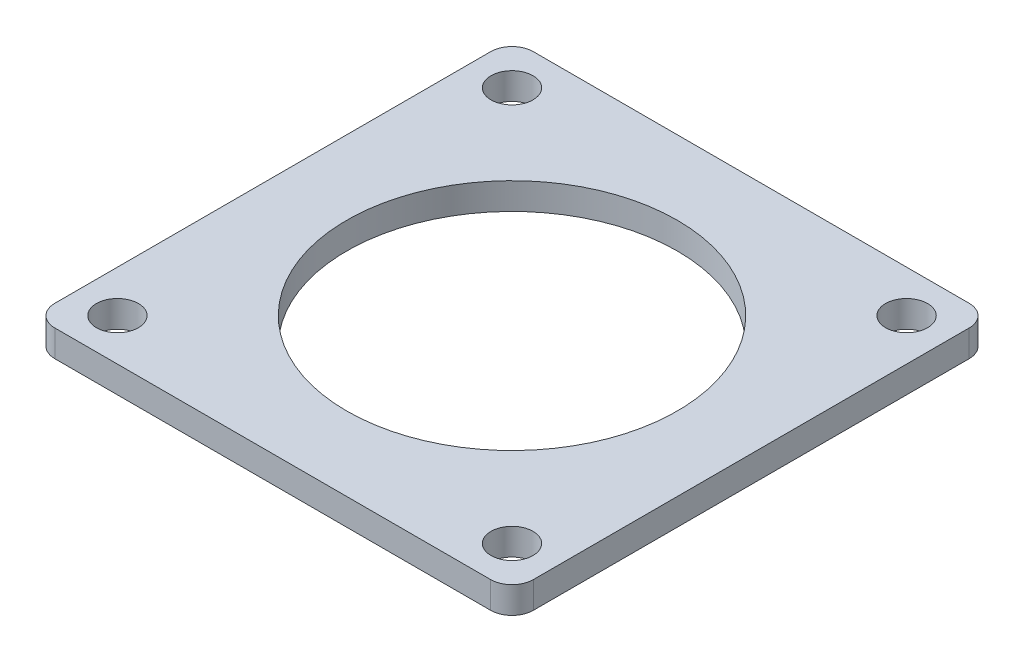
ISO-10303-21;
HEADER;
FILE_DESCRIPTION(('STEP AP214'),'2;1');
FILE_NAME('part.step','',(''),(''),'','','');
FILE_SCHEMA(('AUTOMOTIVE_DESIGN { 1 0 10303 214 1 1 1 1 }'));
ENDSEC;
DATA;
#1=APPLICATION_CONTEXT('core data for automotive mechanical design processes');
#2=APPLICATION_PROTOCOL_DEFINITION('international standard','automotive_design',2000,#1);
#3=PRODUCT_CONTEXT('',#1,'mechanical');
#4=PRODUCT('Part','Part','',(#3));
#5=PRODUCT_RELATED_PRODUCT_CATEGORY('part','',(#4));
#6=PRODUCT_DEFINITION_FORMATION('','',#4);
#7=PRODUCT_DEFINITION_CONTEXT('part definition',#1,'design');
#8=PRODUCT_DEFINITION('design','',#6,#7);
#9=PRODUCT_DEFINITION_SHAPE('','',#8);
#10=(LENGTH_UNIT() NAMED_UNIT(*) SI_UNIT(.MILLI.,.METRE.));
#11=(NAMED_UNIT(*) PLANE_ANGLE_UNIT() SI_UNIT($,.RADIAN.));
#12=(NAMED_UNIT(*) SI_UNIT($,.STERADIAN.) SOLID_ANGLE_UNIT());
#13=UNCERTAINTY_MEASURE_WITH_UNIT(LENGTH_MEASURE(1.E-05),#10,'distance_accuracy_value','');
#14=(GEOMETRIC_REPRESENTATION_CONTEXT(3) GLOBAL_UNCERTAINTY_ASSIGNED_CONTEXT((#13)) GLOBAL_UNIT_ASSIGNED_CONTEXT((#10,
#11,#12)) REPRESENTATION_CONTEXT('',''));
#15=CARTESIAN_POINT('',(0.,0.,0.));
#16=DIRECTION('',(0.,0.,1.));
#17=DIRECTION('',(1.,0.,0.));
#18=AXIS2_PLACEMENT_3D('',#15,#16,#17);
#19=CARTESIAN_POINT('',(25.9599938,3.175,-25.9599938));
#20=DIRECTION('',(0.,1.,0.));
#21=DIRECTION('',(0.,0.,1.));
#22=AXIS2_PLACEMENT_3D('',#19,#20,#21);
#23=PLANE('',#22);
#24=CARTESIAN_POINT('',(23.5000038000013,3.175,23.5000037999987));
#25=DIRECTION('',(0.,1.,0.));
#26=DIRECTION('',(0.,0.,1.));
#27=AXIS2_PLACEMENT_3D('',#24,#25,#26);
#28=CIRCLE('',#27,2.49999500000186);
#29=CARTESIAN_POINT('',(23.5000038000013,3.175,25.9999988000005));
#30=VERTEX_POINT('',#29);
#31=EDGE_CURVE('E198',#30,#30,#28,.T.);
#32=ORIENTED_EDGE('',*,*,#31,.F.);
#33=EDGE_LOOP('',(#32));
#34=FACE_BOUND('',#33,.T.);
#35=CARTESIAN_POINT('',(-23.5000038,3.175,-23.5000038));
#36=DIRECTION('',(0.,1.,0.));
#37=DIRECTION('',(0.,0.,1.));
#38=AXIS2_PLACEMENT_3D('',#35,#36,#37);
#39=CIRCLE('',#38,2.499995);
#40=CARTESIAN_POINT('',(-23.5000038,3.175,-21.0000088));
#41=VERTEX_POINT('',#40);
#42=EDGE_CURVE('E186',#41,#41,#39,.T.);
#43=ORIENTED_EDGE('',*,*,#42,.F.);
#44=EDGE_LOOP('',(#43));
#45=FACE_BOUND('',#44,.T.);
#46=DIRECTION('',(-1.,0.,0.));
#47=VECTOR('',#46,1.);
#48=CARTESIAN_POINT('',(-13.9933145966194,3.175,-28.4999938));
#49=LINE('',#48,#47);
#50=CARTESIAN_POINT('',(25.9599938,3.175,-28.4999938));
#51=VERTEX_POINT('',#50);
#52=CARTESIAN_POINT('',(-25.9599938,3.175,-28.4999938));
#53=VERTEX_POINT('',#52);
#54=EDGE_CURVE('E51',#51,#53,#49,.T.);
#55=ORIENTED_EDGE('',*,*,#54,.T.);
#56=CARTESIAN_POINT('',(-25.9599938,3.175,-25.9599938));
#57=DIRECTION('',(0.,1.,0.));
#58=DIRECTION('',(0.,0.,1.));
#59=AXIS2_PLACEMENT_3D('',#56,#57,#58);
#60=CIRCLE('',#59,2.54);
#61=CARTESIAN_POINT('',(-28.4999938,3.175,-25.9599938));
#62=VERTEX_POINT('',#61);
#63=EDGE_CURVE('E164',#53,#62,#60,.T.);
#64=ORIENTED_EDGE('',*,*,#63,.T.);
#65=DIRECTION('',(0.,0.,1.));
#66=VECTOR('',#65,1.);
#67=CARTESIAN_POINT('',(-28.4999938,3.175,-13.9933145966194));
#68=LINE('',#67,#66);
#69=CARTESIAN_POINT('',(-28.4999938,3.175,25.9599938));
#70=VERTEX_POINT('',#69);
#71=EDGE_CURVE('E161',#62,#70,#68,.T.);
#72=ORIENTED_EDGE('',*,*,#71,.T.);
#73=CARTESIAN_POINT('',(-25.9599938,3.175,25.9599938));
#74=DIRECTION('',(0.,1.,0.));
#75=DIRECTION('',(0.,0.,-1.));
#76=AXIS2_PLACEMENT_3D('',#73,#74,#75);
#77=CIRCLE('',#76,2.54);
#78=CARTESIAN_POINT('',(-25.9599938,3.175,28.4999938));
#79=VERTEX_POINT('',#78);
#80=EDGE_CURVE('E177',#70,#79,#77,.T.);
#81=ORIENTED_EDGE('',*,*,#80,.T.);
#82=DIRECTION('',(1.,0.,0.));
#83=VECTOR('',#82,1.);
#84=CARTESIAN_POINT('',(-13.9933145966194,3.175,28.4999938));
#85=LINE('',#84,#83);
#86=CARTESIAN_POINT('',(25.9599938,3.175,28.4999938));
#87=VERTEX_POINT('',#86);
#88=EDGE_CURVE('E110',#79,#87,#85,.T.);
#89=ORIENTED_EDGE('',*,*,#88,.T.);
#90=CARTESIAN_POINT('',(25.9599938,3.175,25.9599938));
#91=DIRECTION('',(0.,1.,0.));
#92=DIRECTION('',(0.,0.,1.));
#93=AXIS2_PLACEMENT_3D('',#90,#91,#92);
#94=CIRCLE('',#93,2.54);
#95=CARTESIAN_POINT('',(28.4999938,3.175,25.9599938));
#96=VERTEX_POINT('',#95);
#97=EDGE_CURVE('E104',#87,#96,#94,.T.);
#98=ORIENTED_EDGE('',*,*,#97,.T.);
#99=DIRECTION('',(0.,0.,-1.));
#100=VECTOR('',#99,1.);
#101=CARTESIAN_POINT('',(28.4999938,3.175,25.9599938));
#102=LINE('',#101,#100);
#103=CARTESIAN_POINT('',(28.4999938,3.175,-25.9599938));
#104=VERTEX_POINT('',#103);
#105=EDGE_CURVE('E108',#96,#104,#102,.T.);
#106=ORIENTED_EDGE('',*,*,#105,.T.);
#107=CARTESIAN_POINT('',(25.9599938,3.175,-25.9599938));
#108=DIRECTION('',(0.,1.,0.));
#109=DIRECTION('',(0.,0.,1.));
#110=AXIS2_PLACEMENT_3D('',#107,#108,#109);
#111=CIRCLE('',#110,2.54);
#112=EDGE_CURVE('E125',#104,#51,#111,.T.);
#113=ORIENTED_EDGE('',*,*,#112,.T.);
#114=EDGE_LOOP('',(#55,#64,#72,#81,#89,#98,#106,#113));
#115=FACE_BOUND('',#114,.T.);
#116=CARTESIAN_POINT('',(0.,3.175,0.));
#117=DIRECTION('',(0.,1.,0.));
#118=DIRECTION('',(0.,0.,1.));
#119=AXIS2_PLACEMENT_3D('',#116,#117,#118);
#120=CIRCLE('',#119,19.685);
#121=CARTESIAN_POINT('',(0.,3.175,19.685));
#122=VERTEX_POINT('',#121);
#123=EDGE_CURVE('E135',#122,#122,#120,.T.);
#124=ORIENTED_EDGE('',*,*,#123,.F.);
#125=EDGE_LOOP('',(#124));
#126=FACE_BOUND('',#125,.T.);
#127=CARTESIAN_POINT('',(23.5000038,3.175,-23.5000038000013));
#128=DIRECTION('',(0.,1.,0.));
#129=DIRECTION('',(0.,0.,1.));
#130=AXIS2_PLACEMENT_3D('',#127,#128,#129);
#131=CIRCLE('',#130,2.49999500000137);
#132=CARTESIAN_POINT('',(23.5000038,3.175,-21.0000088));
#133=VERTEX_POINT('',#132);
#134=EDGE_CURVE('E192',#133,#133,#131,.T.);
#135=ORIENTED_EDGE('',*,*,#134,.F.);
#136=EDGE_LOOP('',(#135));
#137=FACE_BOUND('',#136,.T.);
#138=CARTESIAN_POINT('',(-23.5000037999987,3.175,23.5000038));
#139=DIRECTION('',(0.,1.,0.));
#140=DIRECTION('',(0.,0.,1.));
#141=AXIS2_PLACEMENT_3D('',#138,#139,#140);
#142=CIRCLE('',#141,2.49999500000069);
#143=CARTESIAN_POINT('',(-23.5000037999987,3.175,25.9999988000007));
#144=VERTEX_POINT('',#143);
#145=EDGE_CURVE('E204',#144,#144,#142,.T.);
#146=ORIENTED_EDGE('',*,*,#145,.F.);
#147=EDGE_LOOP('',(#146));
#148=FACE_BOUND('',#147,.T.);
#149=ADVANCED_FACE('F34',(#34,#45,#115,#126,#137,#148),#23,.T.);
#150=CARTESIAN_POINT('',(25.9599938,0.,-25.9599938));
#151=DIRECTION('',(0.,1.,0.));
#152=DIRECTION('',(0.,0.,1.));
#153=AXIS2_PLACEMENT_3D('',#150,#151,#152);
#154=PLANE('',#153);
#155=CARTESIAN_POINT('',(-25.9599938,0.,-25.9599938));
#156=DIRECTION('',(0.,1.,0.));
#157=DIRECTION('',(0.,0.,1.));
#158=AXIS2_PLACEMENT_3D('',#155,#156,#157);
#159=CIRCLE('',#158,2.54);
#160=CARTESIAN_POINT('',(-25.9599938,0.,-28.4999938));
#161=VERTEX_POINT('',#160);
#162=CARTESIAN_POINT('',(-28.4999938,0.,-25.9599938));
#163=VERTEX_POINT('',#162);
#164=EDGE_CURVE('E131',#161,#163,#159,.T.);
#165=ORIENTED_EDGE('',*,*,#164,.F.);
#166=DIRECTION('',(-1.,0.,0.));
#167=VECTOR('',#166,1.);
#168=CARTESIAN_POINT('',(25.9599938,0.,-28.4999938));
#169=LINE('',#168,#167);
#170=CARTESIAN_POINT('',(25.9599938,0.,-28.4999938));
#171=VERTEX_POINT('',#170);
#172=EDGE_CURVE('E145',#171,#161,#169,.T.);
#173=ORIENTED_EDGE('',*,*,#172,.F.);
#174=CARTESIAN_POINT('',(25.9599938,0.,-25.9599938));
#175=DIRECTION('',(0.,1.,0.));
#176=DIRECTION('',(0.,0.,1.));
#177=AXIS2_PLACEMENT_3D('',#174,#175,#176);
#178=CIRCLE('',#177,2.54);
#179=CARTESIAN_POINT('',(28.4999938,0.,-25.9599938));
#180=VERTEX_POINT('',#179);
#181=EDGE_CURVE('E87',#180,#171,#178,.T.);
#182=ORIENTED_EDGE('',*,*,#181,.F.);
#183=DIRECTION('',(0.,0.,-1.));
#184=VECTOR('',#183,1.);
#185=CARTESIAN_POINT('',(28.4999938,0.,-13.9933145966194));
#186=LINE('',#185,#184);
#187=CARTESIAN_POINT('',(28.4999938,0.,25.9599938));
#188=VERTEX_POINT('',#187);
#189=EDGE_CURVE('E80',#188,#180,#186,.T.);
#190=ORIENTED_EDGE('',*,*,#189,.F.);
#191=CARTESIAN_POINT('',(25.9599938,0.,25.9599938));
#192=DIRECTION('',(0.,1.,0.));
#193=DIRECTION('',(0.,0.,1.));
#194=AXIS2_PLACEMENT_3D('',#191,#192,#193);
#195=CIRCLE('',#194,2.54);
#196=CARTESIAN_POINT('',(25.9599938,0.,28.4999938));
#197=VERTEX_POINT('',#196);
#198=EDGE_CURVE('E119',#197,#188,#195,.T.);
#199=ORIENTED_EDGE('',*,*,#198,.F.);
#200=DIRECTION('',(1.,0.,0.));
#201=VECTOR('',#200,1.);
#202=CARTESIAN_POINT('',(25.9599938,0.,28.4999938));
#203=LINE('',#202,#201);
#204=CARTESIAN_POINT('',(-25.9599938,0.,28.4999938));
#205=VERTEX_POINT('',#204);
#206=EDGE_CURVE('E140',#205,#197,#203,.T.);
#207=ORIENTED_EDGE('',*,*,#206,.F.);
#208=CARTESIAN_POINT('',(-25.9599938,0.,25.9599938));
#209=DIRECTION('',(0.,1.,0.));
#210=DIRECTION('',(0.,0.,-1.));
#211=AXIS2_PLACEMENT_3D('',#208,#209,#210);
#212=CIRCLE('',#211,2.54);
#213=CARTESIAN_POINT('',(-28.4999938,0.,25.9599938));
#214=VERTEX_POINT('',#213);
#215=EDGE_CURVE('E137',#214,#205,#212,.T.);
#216=ORIENTED_EDGE('',*,*,#215,.F.);
#217=DIRECTION('',(0.,0.,1.));
#218=VECTOR('',#217,1.);
#219=CARTESIAN_POINT('',(-28.4999938,0.,25.9599938));
#220=LINE('',#219,#218);
#221=EDGE_CURVE('E134',#163,#214,#220,.T.);
#222=ORIENTED_EDGE('',*,*,#221,.F.);
#223=EDGE_LOOP('',(#165,#173,#182,#190,#199,#207,#216,#222));
#224=FACE_BOUND('',#223,.T.);
#225=CARTESIAN_POINT('',(0.,0.,0.));
#226=DIRECTION('',(0.,1.,0.));
#227=DIRECTION('',(0.,0.,1.));
#228=AXIS2_PLACEMENT_3D('',#225,#226,#227);
#229=CIRCLE('',#228,19.685);
#230=CARTESIAN_POINT('',(0.,0.,19.685));
#231=VERTEX_POINT('',#230);
#232=EDGE_CURVE('E183',#231,#231,#229,.T.);
#233=ORIENTED_EDGE('',*,*,#232,.T.);
#234=EDGE_LOOP('',(#233));
#235=FACE_BOUND('',#234,.T.);
#236=CARTESIAN_POINT('',(-23.5000038,0.,-23.5000038));
#237=DIRECTION('',(0.,1.,0.));
#238=DIRECTION('',(0.,0.,1.));
#239=AXIS2_PLACEMENT_3D('',#236,#237,#238);
#240=CIRCLE('',#239,2.499995);
#241=CARTESIAN_POINT('',(-23.5000038,0.,-21.0000088));
#242=VERTEX_POINT('',#241);
#243=EDGE_CURVE('E189',#242,#242,#240,.T.);
#244=ORIENTED_EDGE('',*,*,#243,.T.);
#245=EDGE_LOOP('',(#244));
#246=FACE_BOUND('',#245,.T.);
#247=CARTESIAN_POINT('',(23.5000038,0.,-23.5000038000013));
#248=DIRECTION('',(0.,1.,0.));
#249=DIRECTION('',(0.,0.,1.));
#250=AXIS2_PLACEMENT_3D('',#247,#248,#249);
#251=CIRCLE('',#250,2.49999500000137);
#252=CARTESIAN_POINT('',(23.5000038,0.,-21.0000088));
#253=VERTEX_POINT('',#252);
#254=EDGE_CURVE('E195',#253,#253,#251,.T.);
#255=ORIENTED_EDGE('',*,*,#254,.T.);
#256=EDGE_LOOP('',(#255));
#257=FACE_BOUND('',#256,.T.);
#258=CARTESIAN_POINT('',(23.5000038000013,0.,23.5000037999987));
#259=DIRECTION('',(0.,1.,0.));
#260=DIRECTION('',(0.,0.,1.));
#261=AXIS2_PLACEMENT_3D('',#258,#259,#260);
#262=CIRCLE('',#261,2.49999500000186);
#263=CARTESIAN_POINT('',(23.5000038000013,0.,25.9999988000005));
#264=VERTEX_POINT('',#263);
#265=EDGE_CURVE('E201',#264,#264,#262,.T.);
#266=ORIENTED_EDGE('',*,*,#265,.T.);
#267=EDGE_LOOP('',(#266));
#268=FACE_BOUND('',#267,.T.);
#269=CARTESIAN_POINT('',(-23.5000037999987,0.,23.5000038));
#270=DIRECTION('',(0.,1.,0.));
#271=DIRECTION('',(0.,0.,1.));
#272=AXIS2_PLACEMENT_3D('',#269,#270,#271);
#273=CIRCLE('',#272,2.49999500000069);
#274=CARTESIAN_POINT('',(-23.5000037999987,0.,25.9999988000007));
#275=VERTEX_POINT('',#274);
#276=EDGE_CURVE('E207',#275,#275,#273,.T.);
#277=ORIENTED_EDGE('',*,*,#276,.T.);
#278=EDGE_LOOP('',(#277));
#279=FACE_BOUND('',#278,.T.);
#280=ADVANCED_FACE('F168',(#224,#235,#246,#257,#268,#279),#154,.F.);
#281=CARTESIAN_POINT('',(-25.9599938,3.175,-25.9599938));
#282=DIRECTION('',(0.,-1.,0.));
#283=DIRECTION('',(0.,0.,-1.));
#284=AXIS2_PLACEMENT_3D('',#281,#282,#283);
#285=CYLINDRICAL_SURFACE('',#284,2.54);
#286=ORIENTED_EDGE('',*,*,#164,.T.);
#287=DIRECTION('',(0.,-1.,0.));
#288=VECTOR('',#287,1.);
#289=CARTESIAN_POINT('',(-28.4999938,3.175,-25.9599938));
#290=LINE('',#289,#288);
#291=EDGE_CURVE('E43',#62,#163,#290,.T.);
#292=ORIENTED_EDGE('',*,*,#291,.F.);
#293=ORIENTED_EDGE('',*,*,#63,.F.);
#294=DIRECTION('',(0.,-1.,0.));
#295=VECTOR('',#294,1.);
#296=CARTESIAN_POINT('',(-25.9599938,3.175,-28.4999938));
#297=LINE('',#296,#295);
#298=EDGE_CURVE('E11',#53,#161,#297,.T.);
#299=ORIENTED_EDGE('',*,*,#298,.T.);
#300=EDGE_LOOP('',(#286,#292,#293,#299));
#301=FACE_BOUND('',#300,.T.);
#302=ADVANCED_FACE('F36',(#301),#285,.T.);
#303=CARTESIAN_POINT('',(-28.4999938,3.175,25.9599938));
#304=DIRECTION('',(1.,0.,0.));
#305=DIRECTION('',(0.,0.,-1.));
#306=AXIS2_PLACEMENT_3D('',#303,#304,#305);
#307=PLANE('',#306);
#308=ORIENTED_EDGE('',*,*,#221,.T.);
#309=DIRECTION('',(0.,-1.,0.));
#310=VECTOR('',#309,1.);
#311=CARTESIAN_POINT('',(-28.4999938,3.175,25.9599938));
#312=LINE('',#311,#310);
#313=EDGE_CURVE('E153',#70,#214,#312,.T.);
#314=ORIENTED_EDGE('',*,*,#313,.F.);
#315=ORIENTED_EDGE('',*,*,#71,.F.);
#316=ORIENTED_EDGE('',*,*,#291,.T.);
#317=EDGE_LOOP('',(#308,#314,#315,#316));
#318=FACE_BOUND('',#317,.T.);
#319=ADVANCED_FACE('F159',(#318),#307,.F.);
#320=CARTESIAN_POINT('',(-25.9599938,3.175,25.9599938));
#321=DIRECTION('',(0.,-1.,0.));
#322=DIRECTION('',(0.,0.,-1.));
#323=AXIS2_PLACEMENT_3D('',#320,#321,#322);
#324=CYLINDRICAL_SURFACE('',#323,2.54);
#325=ORIENTED_EDGE('',*,*,#215,.T.);
#326=DIRECTION('',(0.,-1.,0.));
#327=VECTOR('',#326,1.);
#328=CARTESIAN_POINT('',(-25.9599938,3.175,28.4999938));
#329=LINE('',#328,#327);
#330=EDGE_CURVE('E150',#79,#205,#329,.T.);
#331=ORIENTED_EDGE('',*,*,#330,.F.);
#332=ORIENTED_EDGE('',*,*,#80,.F.);
#333=ORIENTED_EDGE('',*,*,#313,.T.);
#334=EDGE_LOOP('',(#325,#331,#332,#333));
#335=FACE_BOUND('',#334,.T.);
#336=ADVANCED_FACE('F173',(#335),#324,.T.);
#337=CARTESIAN_POINT('',(25.9599938,3.175,28.4999938));
#338=DIRECTION('',(0.,0.,-1.));
#339=DIRECTION('',(-1.,0.,0.));
#340=AXIS2_PLACEMENT_3D('',#337,#338,#339);
#341=PLANE('',#340);
#342=ORIENTED_EDGE('',*,*,#206,.T.);
#343=DIRECTION('',(0.,-1.,0.));
#344=VECTOR('',#343,1.);
#345=CARTESIAN_POINT('',(25.9599938,3.175,28.4999938));
#346=LINE('',#345,#344);
#347=EDGE_CURVE('E120',#87,#197,#346,.T.);
#348=ORIENTED_EDGE('',*,*,#347,.F.);
#349=ORIENTED_EDGE('',*,*,#88,.F.);
#350=ORIENTED_EDGE('',*,*,#330,.T.);
#351=EDGE_LOOP('',(#342,#348,#349,#350));
#352=FACE_BOUND('',#351,.T.);
#353=ADVANCED_FACE('F176',(#352),#341,.F.);
#354=CARTESIAN_POINT('',(25.9599938,3.175,25.9599938));
#355=DIRECTION('',(0.,-1.,0.));
#356=DIRECTION('',(0.,0.,-1.));
#357=AXIS2_PLACEMENT_3D('',#354,#355,#356);
#358=CYLINDRICAL_SURFACE('',#357,2.54);
#359=ORIENTED_EDGE('',*,*,#198,.T.);
#360=DIRECTION('',(0.,-1.,0.));
#361=VECTOR('',#360,1.);
#362=CARTESIAN_POINT('',(28.4999938,3.175,25.9599938));
#363=LINE('',#362,#361);
#364=EDGE_CURVE('E116',#96,#188,#363,.T.);
#365=ORIENTED_EDGE('',*,*,#364,.F.);
#366=ORIENTED_EDGE('',*,*,#97,.F.);
#367=ORIENTED_EDGE('',*,*,#347,.T.);
#368=EDGE_LOOP('',(#359,#365,#366,#367));
#369=FACE_BOUND('',#368,.T.);
#370=ADVANCED_FACE('F117',(#369),#358,.T.);
#371=CARTESIAN_POINT('',(28.4999938,3.175,-13.9933145966194));
#372=DIRECTION('',(-1.,0.,0.));
#373=DIRECTION('',(0.,0.,1.));
#374=AXIS2_PLACEMENT_3D('',#371,#372,#373);
#375=PLANE('',#374);
#376=ORIENTED_EDGE('',*,*,#189,.T.);
#377=DIRECTION('',(0.,-1.,0.));
#378=VECTOR('',#377,1.);
#379=CARTESIAN_POINT('',(28.4999938,3.175,-25.9599938));
#380=LINE('',#379,#378);
#381=EDGE_CURVE('E121',#104,#180,#380,.T.);
#382=ORIENTED_EDGE('',*,*,#381,.F.);
#383=ORIENTED_EDGE('',*,*,#105,.F.);
#384=ORIENTED_EDGE('',*,*,#364,.T.);
#385=EDGE_LOOP('',(#376,#382,#383,#384));
#386=FACE_BOUND('',#385,.T.);
#387=ADVANCED_FACE('F123',(#386),#375,.F.);
#388=CARTESIAN_POINT('',(25.9599938,3.175,-25.9599938));
#389=DIRECTION('',(0.,-1.,0.));
#390=DIRECTION('',(0.,0.,-1.));
#391=AXIS2_PLACEMENT_3D('',#388,#389,#390);
#392=CYLINDRICAL_SURFACE('',#391,2.54);
#393=ORIENTED_EDGE('',*,*,#181,.T.);
#394=DIRECTION('',(0.,-1.,0.));
#395=VECTOR('',#394,1.);
#396=CARTESIAN_POINT('',(25.9599938,3.175,-28.4999938));
#397=LINE('',#396,#395);
#398=EDGE_CURVE('E127',#51,#171,#397,.T.);
#399=ORIENTED_EDGE('',*,*,#398,.F.);
#400=ORIENTED_EDGE('',*,*,#112,.F.);
#401=ORIENTED_EDGE('',*,*,#381,.T.);
#402=EDGE_LOOP('',(#393,#399,#400,#401));
#403=FACE_BOUND('',#402,.T.);
#404=ADVANCED_FACE('F232',(#403),#392,.T.);
#405=CARTESIAN_POINT('',(25.9599938,3.175,-28.4999938));
#406=DIRECTION('',(0.,0.,1.));
#407=DIRECTION('',(1.,0.,0.));
#408=AXIS2_PLACEMENT_3D('',#405,#406,#407);
#409=PLANE('',#408);
#410=ORIENTED_EDGE('',*,*,#172,.T.);
#411=ORIENTED_EDGE('',*,*,#298,.F.);
#412=ORIENTED_EDGE('',*,*,#54,.F.);
#413=ORIENTED_EDGE('',*,*,#398,.T.);
#414=EDGE_LOOP('',(#410,#411,#412,#413));
#415=FACE_BOUND('',#414,.T.);
#416=ADVANCED_FACE('F229',(#415),#409,.F.);
#417=CARTESIAN_POINT('',(0.,3.175,0.));
#418=DIRECTION('',(0.,-1.,0.));
#419=DIRECTION('',(0.,0.,-1.));
#420=AXIS2_PLACEMENT_3D('',#417,#418,#419);
#421=CYLINDRICAL_SURFACE('',#420,19.685);
#422=ORIENTED_EDGE('',*,*,#123,.T.);
#423=EDGE_LOOP('',(#422));
#424=FACE_BOUND('',#423,.T.);
#425=ORIENTED_EDGE('',*,*,#232,.F.);
#426=EDGE_LOOP('',(#425));
#427=FACE_BOUND('',#426,.T.);
#428=ADVANCED_FACE('F226',(#424,#427),#421,.F.);
#429=CARTESIAN_POINT('',(-23.5000038,3.175,-23.5000038));
#430=DIRECTION('',(0.,-1.,0.));
#431=DIRECTION('',(0.,0.,-1.));
#432=AXIS2_PLACEMENT_3D('',#429,#430,#431);
#433=CYLINDRICAL_SURFACE('',#432,2.499995);
#434=ORIENTED_EDGE('',*,*,#42,.T.);
#435=EDGE_LOOP('',(#434));
#436=FACE_BOUND('',#435,.T.);
#437=ORIENTED_EDGE('',*,*,#243,.F.);
#438=EDGE_LOOP('',(#437));
#439=FACE_BOUND('',#438,.T.);
#440=ADVANCED_FACE('F326',(#436,#439),#433,.F.);
#441=CARTESIAN_POINT('',(23.5000038,3.175,-23.5000038000013));
#442=DIRECTION('',(0.,-1.,0.));
#443=DIRECTION('',(0.,0.,-1.));
#444=AXIS2_PLACEMENT_3D('',#441,#442,#443);
#445=CYLINDRICAL_SURFACE('',#444,2.49999500000137);
#446=ORIENTED_EDGE('',*,*,#134,.T.);
#447=EDGE_LOOP('',(#446));
#448=FACE_BOUND('',#447,.T.);
#449=ORIENTED_EDGE('',*,*,#254,.F.);
#450=EDGE_LOOP('',(#449));
#451=FACE_BOUND('',#450,.T.);
#452=ADVANCED_FACE('F334',(#448,#451),#445,.F.);
#453=CARTESIAN_POINT('',(23.5000038000013,3.175,23.5000037999987));
#454=DIRECTION('',(0.,-1.,0.));
#455=DIRECTION('',(0.,0.,-1.));
#456=AXIS2_PLACEMENT_3D('',#453,#454,#455);
#457=CYLINDRICAL_SURFACE('',#456,2.49999500000186);
#458=ORIENTED_EDGE('',*,*,#31,.T.);
#459=EDGE_LOOP('',(#458));
#460=FACE_BOUND('',#459,.T.);
#461=ORIENTED_EDGE('',*,*,#265,.F.);
#462=EDGE_LOOP('',(#461));
#463=FACE_BOUND('',#462,.T.);
#464=ADVANCED_FACE('F342',(#460,#463),#457,.F.);
#465=CARTESIAN_POINT('',(-23.5000037999987,3.175,23.5000038));
#466=DIRECTION('',(0.,-1.,0.));
#467=DIRECTION('',(0.,0.,-1.));
#468=AXIS2_PLACEMENT_3D('',#465,#466,#467);
#469=CYLINDRICAL_SURFACE('',#468,2.49999500000069);
#470=ORIENTED_EDGE('',*,*,#145,.T.);
#471=EDGE_LOOP('',(#470));
#472=FACE_BOUND('',#471,.T.);
#473=ORIENTED_EDGE('',*,*,#276,.F.);
#474=EDGE_LOOP('',(#473));
#475=FACE_BOUND('',#474,.T.);
#476=ADVANCED_FACE('F213',(#472,#475),#469,.F.);
#477=CLOSED_SHELL('',(#149,#280,#302,#319,#336,#353,#370,#387,#404,#416,#428,#440,#452,#464,#476));
#478=MANIFOLD_SOLID_BREP('B2',#477);
#479=ADVANCED_BREP_SHAPE_REPRESENTATION('',(#18,#478),#14);
#480=SHAPE_DEFINITION_REPRESENTATION(#9,#479);
ENDSEC;
END-ISO-10303-21;
